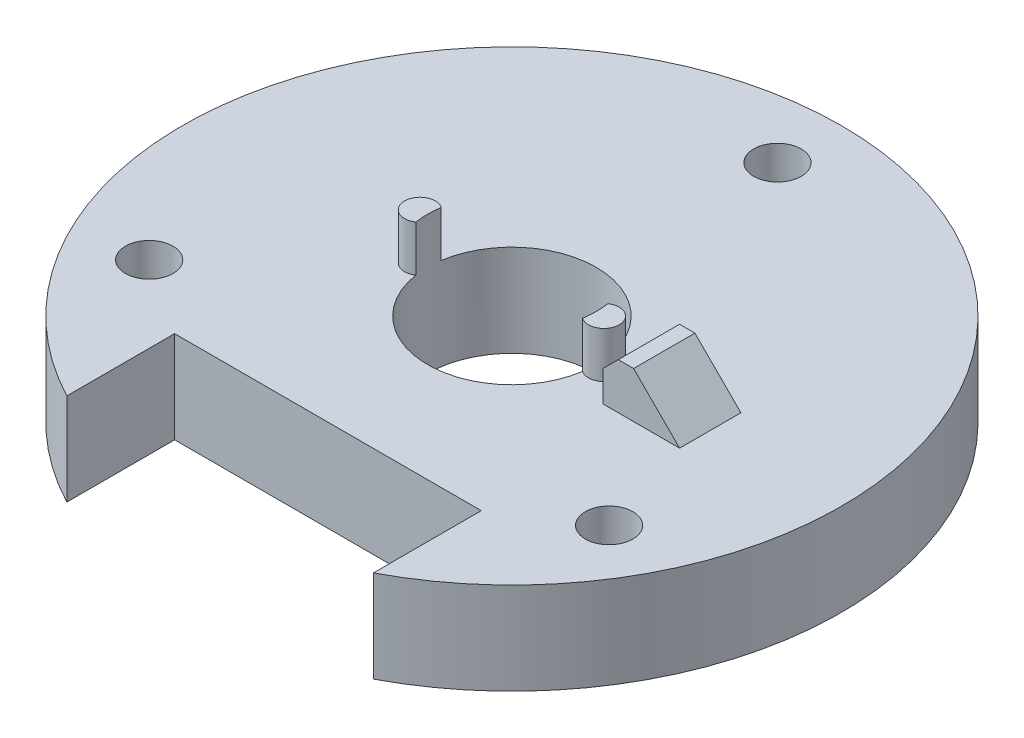
ISO-10303-21;
HEADER;
FILE_DESCRIPTION(('STEP AP214'),'2;1');
FILE_NAME('part.step','',(''),(''),'','','');
FILE_SCHEMA(('AUTOMOTIVE_DESIGN { 1 0 10303 214 1 1 1 1 }'));
ENDSEC;
DATA;
#1=APPLICATION_CONTEXT('core data for automotive mechanical design processes');
#2=APPLICATION_PROTOCOL_DEFINITION('international standard','automotive_design',2000,#1);
#3=PRODUCT_CONTEXT('',#1,'mechanical');
#4=PRODUCT('Part','Part','',(#3));
#5=PRODUCT_RELATED_PRODUCT_CATEGORY('part','',(#4));
#6=PRODUCT_DEFINITION_FORMATION('','',#4);
#7=PRODUCT_DEFINITION_CONTEXT('part definition',#1,'design');
#8=PRODUCT_DEFINITION('design','',#6,#7);
#9=PRODUCT_DEFINITION_SHAPE('','',#8);
#10=(LENGTH_UNIT() NAMED_UNIT(*) SI_UNIT(.MILLI.,.METRE.));
#11=(NAMED_UNIT(*) PLANE_ANGLE_UNIT() SI_UNIT($,.RADIAN.));
#12=(NAMED_UNIT(*) SI_UNIT($,.STERADIAN.) SOLID_ANGLE_UNIT());
#13=UNCERTAINTY_MEASURE_WITH_UNIT(LENGTH_MEASURE(1.E-05),#10,'distance_accuracy_value','');
#14=(GEOMETRIC_REPRESENTATION_CONTEXT(3) GLOBAL_UNCERTAINTY_ASSIGNED_CONTEXT((#13)) GLOBAL_UNIT_ASSIGNED_CONTEXT((#10,
#11,#12)) REPRESENTATION_CONTEXT('',''));
#15=CARTESIAN_POINT('',(0.,0.,0.));
#16=DIRECTION('',(0.,0.,1.));
#17=DIRECTION('',(1.,0.,0.));
#18=AXIS2_PLACEMENT_3D('',#15,#16,#17);
#19=CARTESIAN_POINT('',(0.,6.,0.));
#20=DIRECTION('',(0.,1.,0.));
#21=DIRECTION('',(0.,0.,1.));
#22=AXIS2_PLACEMENT_3D('',#19,#20,#21);
#23=PLANE('',#22);
#24=CARTESIAN_POINT('',(0.,6.,0.));
#25=DIRECTION('',(0.,1.,0.));
#26=DIRECTION('',(0.,0.,1.));
#27=AXIS2_PLACEMENT_3D('',#24,#25,#26);
#28=CIRCLE('',#27,5.5);
#29=CARTESIAN_POINT('',(-5.4375,6.,0.826797284707685));
#30=VERTEX_POINT('',#29);
#31=CARTESIAN_POINT('',(5.4375,6.,0.826797284707722));
#32=VERTEX_POINT('',#31);
#33=EDGE_CURVE('E210',#30,#32,#28,.T.);
#34=ORIENTED_EDGE('',*,*,#33,.F.);
#35=CARTESIAN_POINT('',(-6.,6.,0.));
#36=DIRECTION('',(0.,1.,0.));
#37=DIRECTION('',(0.,0.,1.));
#38=AXIS2_PLACEMENT_3D('',#35,#36,#37);
#39=CIRCLE('',#38,1.);
#40=CARTESIAN_POINT('',(-5.4375,6.,-0.826797284707684));
#41=VERTEX_POINT('',#40);
#42=EDGE_CURVE('E168',#41,#30,#39,.T.);
#43=ORIENTED_EDGE('',*,*,#42,.F.);
#44=CARTESIAN_POINT('',(5.43750000000001,6.,-0.826797284707646));
#45=VERTEX_POINT('',#44);
#46=EDGE_CURVE('E211',#45,#41,#28,.T.);
#47=ORIENTED_EDGE('',*,*,#46,.F.);
#48=CARTESIAN_POINT('',(6.,6.,0.));
#49=DIRECTION('',(0.,1.,0.));
#50=DIRECTION('',(0.,0.,1.));
#51=AXIS2_PLACEMENT_3D('',#48,#49,#50);
#52=CIRCLE('',#51,0.999999999999999);
#53=EDGE_CURVE('E171',#32,#45,#52,.T.);
#54=ORIENTED_EDGE('',*,*,#53,.F.);
#55=EDGE_LOOP('',(#34,#43,#47,#54));
#56=FACE_BOUND('',#55,.T.);
#57=DIRECTION('',(0.,0.,-1.));
#58=VECTOR('',#57,1.);
#59=CARTESIAN_POINT('',(10.,6.,0.));
#60=LINE('',#59,#58);
#61=CARTESIAN_POINT('',(10.,6.,19.0328663106743));
#62=VERTEX_POINT('',#61);
#63=CARTESIAN_POINT('',(10.,6.,12.));
#64=VERTEX_POINT('',#63);
#65=EDGE_CURVE('E206',#62,#64,#60,.T.);
#66=ORIENTED_EDGE('',*,*,#65,.F.);
#67=CARTESIAN_POINT('',(0.,6.,0.));
#68=DIRECTION('',(0.,1.,0.));
#69=DIRECTION('',(0.,0.,1.));
#70=AXIS2_PLACEMENT_3D('',#67,#68,#69);
#71=CIRCLE('',#70,21.5);
#72=CARTESIAN_POINT('',(-10.,6.,19.0328663106743));
#73=VERTEX_POINT('',#72);
#74=EDGE_CURVE('E233',#62,#73,#71,.T.);
#75=ORIENTED_EDGE('',*,*,#74,.T.);
#76=DIRECTION('',(0.,0.,1.));
#77=VECTOR('',#76,1.);
#78=CARTESIAN_POINT('',(-10.,6.,0.));
#79=LINE('',#78,#77);
#80=CARTESIAN_POINT('',(-10.,6.,12.));
#81=VERTEX_POINT('',#80);
#82=EDGE_CURVE('E193',#81,#73,#79,.T.);
#83=ORIENTED_EDGE('',*,*,#82,.F.);
#84=DIRECTION('',(-1.,0.,0.));
#85=VECTOR('',#84,1.);
#86=CARTESIAN_POINT('',(0.,6.,12.));
#87=LINE('',#86,#85);
#88=EDGE_CURVE('E208',#64,#81,#87,.T.);
#89=ORIENTED_EDGE('',*,*,#88,.F.);
#90=EDGE_LOOP('',(#66,#75,#83,#89));
#91=FACE_BOUND('',#90,.T.);
#92=CARTESIAN_POINT('',(15.,6.,8.66));
#93=DIRECTION('',(0.,1.,0.));
#94=DIRECTION('',(0.,0.,1.));
#95=AXIS2_PLACEMENT_3D('',#92,#93,#94);
#96=CIRCLE('',#95,1.55);
#97=CARTESIAN_POINT('',(15.,6.,10.21));
#98=VERTEX_POINT('',#97);
#99=EDGE_CURVE('E221',#98,#98,#96,.T.);
#100=ORIENTED_EDGE('',*,*,#99,.F.);
#101=EDGE_LOOP('',(#100));
#102=FACE_BOUND('',#101,.T.);
#103=CARTESIAN_POINT('',(0.,6.,-17.3207621135332));
#104=DIRECTION('',(0.,1.,0.));
#105=DIRECTION('',(0.,0.,1.));
#106=AXIS2_PLACEMENT_3D('',#103,#104,#105);
#107=CIRCLE('',#106,1.55);
#108=CARTESIAN_POINT('',(0.,6.,-15.7707621135332));
#109=VERTEX_POINT('',#108);
#110=EDGE_CURVE('E227',#109,#109,#107,.T.);
#111=ORIENTED_EDGE('',*,*,#110,.F.);
#112=EDGE_LOOP('',(#111));
#113=FACE_BOUND('',#112,.T.);
#114=CARTESIAN_POINT('',(-15.,6.,8.66));
#115=DIRECTION('',(0.,1.,0.));
#116=DIRECTION('',(0.,0.,1.));
#117=AXIS2_PLACEMENT_3D('',#114,#115,#116);
#118=CIRCLE('',#117,1.55);
#119=CARTESIAN_POINT('',(-15.,6.,10.21));
#120=VERTEX_POINT('',#119);
#121=EDGE_CURVE('E215',#120,#120,#118,.T.);
#122=ORIENTED_EDGE('',*,*,#121,.F.);
#123=EDGE_LOOP('',(#122));
#124=FACE_BOUND('',#123,.T.);
#125=DIRECTION('',(-1.,0.,0.));
#126=VECTOR('',#125,1.);
#127=CARTESIAN_POINT('',(7.93750000000001,6.,-2.));
#128=LINE('',#127,#126);
#129=CARTESIAN_POINT('',(12.9375,6.,-2.));
#130=VERTEX_POINT('',#129);
#131=CARTESIAN_POINT('',(7.93750000000001,6.,-2.));
#132=VERTEX_POINT('',#131);
#133=EDGE_CURVE('E55',#130,#132,#128,.T.);
#134=ORIENTED_EDGE('',*,*,#133,.F.);
#135=DIRECTION('',(0.,0.,1.));
#136=VECTOR('',#135,1.);
#137=CARTESIAN_POINT('',(12.9375,6.,0.));
#138=LINE('',#137,#136);
#139=CARTESIAN_POINT('',(12.9375,6.,2.));
#140=VERTEX_POINT('',#139);
#141=EDGE_CURVE('E251',#130,#140,#138,.T.);
#142=ORIENTED_EDGE('',*,*,#141,.T.);
#143=DIRECTION('',(1.,0.,0.));
#144=VECTOR('',#143,1.);
#145=CARTESIAN_POINT('',(7.93750000000001,6.,2.));
#146=LINE('',#145,#144);
#147=CARTESIAN_POINT('',(7.93750000000001,6.,2.));
#148=VERTEX_POINT('',#147);
#149=EDGE_CURVE('E62',#148,#140,#146,.T.);
#150=ORIENTED_EDGE('',*,*,#149,.F.);
#151=DIRECTION('',(0.,0.,1.));
#152=VECTOR('',#151,1.);
#153=CARTESIAN_POINT('',(7.93750000000001,6.,-2.));
#154=LINE('',#153,#152);
#155=EDGE_CURVE('E155',#132,#148,#154,.T.);
#156=ORIENTED_EDGE('',*,*,#155,.F.);
#157=EDGE_LOOP('',(#134,#142,#150,#156));
#158=FACE_BOUND('',#157,.T.);
#159=ADVANCED_FACE('F39',(#56,#91,#102,#113,#124,#158),#23,.T.);
#160=CARTESIAN_POINT('',(0.,0.,0.));
#161=DIRECTION('',(0.,1.,0.));
#162=DIRECTION('',(0.,0.,1.));
#163=AXIS2_PLACEMENT_3D('',#160,#161,#162);
#164=PLANE('',#163);
#165=CARTESIAN_POINT('',(0.,0.,0.));
#166=DIRECTION('',(0.,-1.,0.));
#167=DIRECTION('',(0.,0.,-1.));
#168=AXIS2_PLACEMENT_3D('',#165,#166,#167);
#169=CIRCLE('',#168,5.5);
#170=CARTESIAN_POINT('',(0.,0.,-5.5));
#171=VERTEX_POINT('',#170);
#172=EDGE_CURVE('E190',#171,#171,#169,.T.);
#173=ORIENTED_EDGE('',*,*,#172,.F.);
#174=EDGE_LOOP('',(#173));
#175=FACE_BOUND('',#174,.T.);
#176=CARTESIAN_POINT('',(0.,0.,0.));
#177=DIRECTION('',(0.,1.,0.));
#178=DIRECTION('',(0.,0.,1.));
#179=AXIS2_PLACEMENT_3D('',#176,#177,#178);
#180=CIRCLE('',#179,21.5);
#181=CARTESIAN_POINT('',(10.,0.,19.0328663106743));
#182=VERTEX_POINT('',#181);
#183=CARTESIAN_POINT('',(-10.,0.,19.0328663106743));
#184=VERTEX_POINT('',#183);
#185=EDGE_CURVE('E230',#182,#184,#180,.T.);
#186=ORIENTED_EDGE('',*,*,#185,.F.);
#187=DIRECTION('',(0.,0.,1.));
#188=VECTOR('',#187,1.);
#189=CARTESIAN_POINT('',(10.,0.,12.));
#190=LINE('',#189,#188);
#191=CARTESIAN_POINT('',(10.,0.,12.));
#192=VERTEX_POINT('',#191);
#193=EDGE_CURVE('E194',#192,#182,#190,.T.);
#194=ORIENTED_EDGE('',*,*,#193,.F.);
#195=DIRECTION('',(1.,0.,0.));
#196=VECTOR('',#195,1.);
#197=CARTESIAN_POINT('',(10.,0.,12.));
#198=LINE('',#197,#196);
#199=CARTESIAN_POINT('',(-10.,0.,12.));
#200=VERTEX_POINT('',#199);
#201=EDGE_CURVE('E197',#200,#192,#198,.T.);
#202=ORIENTED_EDGE('',*,*,#201,.F.);
#203=DIRECTION('',(0.,0.,-1.));
#204=VECTOR('',#203,1.);
#205=CARTESIAN_POINT('',(-10.,0.,12.));
#206=LINE('',#205,#204);
#207=EDGE_CURVE('E201',#184,#200,#206,.T.);
#208=ORIENTED_EDGE('',*,*,#207,.F.);
#209=EDGE_LOOP('',(#186,#194,#202,#208));
#210=FACE_BOUND('',#209,.T.);
#211=CARTESIAN_POINT('',(0.,0.,-17.3207621135332));
#212=DIRECTION('',(0.,1.,0.));
#213=DIRECTION('',(0.,0.,1.));
#214=AXIS2_PLACEMENT_3D('',#211,#212,#213);
#215=CIRCLE('',#214,1.55);
#216=CARTESIAN_POINT('',(0.,0.,-15.7707621135332));
#217=VERTEX_POINT('',#216);
#218=EDGE_CURVE('E224',#217,#217,#215,.T.);
#219=ORIENTED_EDGE('',*,*,#218,.T.);
#220=EDGE_LOOP('',(#219));
#221=FACE_BOUND('',#220,.T.);
#222=CARTESIAN_POINT('',(15.,0.,8.66));
#223=DIRECTION('',(0.,1.,0.));
#224=DIRECTION('',(0.,0.,1.));
#225=AXIS2_PLACEMENT_3D('',#222,#223,#224);
#226=CIRCLE('',#225,1.55);
#227=CARTESIAN_POINT('',(15.,0.,10.21));
#228=VERTEX_POINT('',#227);
#229=EDGE_CURVE('E218',#228,#228,#226,.T.);
#230=ORIENTED_EDGE('',*,*,#229,.T.);
#231=EDGE_LOOP('',(#230));
#232=FACE_BOUND('',#231,.T.);
#233=CARTESIAN_POINT('',(-15.,0.,8.66));
#234=DIRECTION('',(0.,1.,0.));
#235=DIRECTION('',(0.,0.,1.));
#236=AXIS2_PLACEMENT_3D('',#233,#234,#235);
#237=CIRCLE('',#236,1.55);
#238=CARTESIAN_POINT('',(-15.,0.,10.21));
#239=VERTEX_POINT('',#238);
#240=EDGE_CURVE('E214',#239,#239,#237,.T.);
#241=ORIENTED_EDGE('',*,*,#240,.T.);
#242=EDGE_LOOP('',(#241));
#243=FACE_BOUND('',#242,.T.);
#244=ADVANCED_FACE('F271',(#175,#210,#221,#232,#243),#164,.F.);
#245=CARTESIAN_POINT('',(0.,6.,0.));
#246=DIRECTION('',(0.,-1.,0.));
#247=DIRECTION('',(0.,0.,-1.));
#248=AXIS2_PLACEMENT_3D('',#245,#246,#247);
#249=CYLINDRICAL_SURFACE('',#248,21.5);
#250=ORIENTED_EDGE('',*,*,#74,.F.);
#251=DIRECTION('',(0.,-1.,0.));
#252=VECTOR('',#251,1.);
#253=CARTESIAN_POINT('',(10.,6.,19.0328663106743));
#254=LINE('',#253,#252);
#255=EDGE_CURVE('E241',#62,#182,#254,.T.);
#256=ORIENTED_EDGE('',*,*,#255,.T.);
#257=ORIENTED_EDGE('',*,*,#185,.T.);
#258=DIRECTION('',(0.,-1.,0.));
#259=VECTOR('',#258,1.);
#260=CARTESIAN_POINT('',(-10.,6.,19.0328663106743));
#261=LINE('',#260,#259);
#262=EDGE_CURVE('E236',#184,#73,#261,.F.);
#263=ORIENTED_EDGE('',*,*,#262,.T.);
#264=EDGE_LOOP('',(#250,#256,#257,#263));
#265=FACE_BOUND('',#264,.T.);
#266=ADVANCED_FACE('F278',(#265),#249,.T.);
#267=CARTESIAN_POINT('',(0.,6.,-17.3207621135332));
#268=DIRECTION('',(0.,-1.,0.));
#269=DIRECTION('',(0.,0.,-1.));
#270=AXIS2_PLACEMENT_3D('',#267,#268,#269);
#271=CYLINDRICAL_SURFACE('',#270,1.55);
#272=ORIENTED_EDGE('',*,*,#110,.T.);
#273=EDGE_LOOP('',(#272));
#274=FACE_BOUND('',#273,.T.);
#275=ORIENTED_EDGE('',*,*,#218,.F.);
#276=EDGE_LOOP('',(#275));
#277=FACE_BOUND('',#276,.T.);
#278=ADVANCED_FACE('F284',(#274,#277),#271,.F.);
#279=CARTESIAN_POINT('',(15.,6.,8.66));
#280=DIRECTION('',(0.,-1.,0.));
#281=DIRECTION('',(0.,0.,-1.));
#282=AXIS2_PLACEMENT_3D('',#279,#280,#281);
#283=CYLINDRICAL_SURFACE('',#282,1.55);
#284=ORIENTED_EDGE('',*,*,#99,.T.);
#285=EDGE_LOOP('',(#284));
#286=FACE_BOUND('',#285,.T.);
#287=ORIENTED_EDGE('',*,*,#229,.F.);
#288=EDGE_LOOP('',(#287));
#289=FACE_BOUND('',#288,.T.);
#290=ADVANCED_FACE('F291',(#286,#289),#283,.F.);
#291=CARTESIAN_POINT('',(-15.,6.,8.66));
#292=DIRECTION('',(0.,-1.,0.));
#293=DIRECTION('',(0.,0.,-1.));
#294=AXIS2_PLACEMENT_3D('',#291,#292,#293);
#295=CYLINDRICAL_SURFACE('',#294,1.55);
#296=ORIENTED_EDGE('',*,*,#121,.T.);
#297=EDGE_LOOP('',(#296));
#298=FACE_BOUND('',#297,.T.);
#299=ORIENTED_EDGE('',*,*,#240,.F.);
#300=EDGE_LOOP('',(#299));
#301=FACE_BOUND('',#300,.T.);
#302=ADVANCED_FACE('F325',(#298,#301),#295,.F.);
#303=CARTESIAN_POINT('',(10.,12.,12.));
#304=DIRECTION('',(1.,0.,0.));
#305=DIRECTION('',(0.,0.,-1.));
#306=AXIS2_PLACEMENT_3D('',#303,#304,#305);
#307=PLANE('',#306);
#308=ORIENTED_EDGE('',*,*,#65,.T.);
#309=DIRECTION('',(0.,-1.,0.));
#310=VECTOR('',#309,1.);
#311=CARTESIAN_POINT('',(10.,12.,12.));
#312=LINE('',#311,#310);
#313=EDGE_CURVE('E189',#64,#192,#312,.T.);
#314=ORIENTED_EDGE('',*,*,#313,.T.);
#315=ORIENTED_EDGE('',*,*,#193,.T.);
#316=ORIENTED_EDGE('',*,*,#255,.F.);
#317=EDGE_LOOP('',(#308,#314,#315,#316));
#318=FACE_BOUND('',#317,.T.);
#319=ADVANCED_FACE('F301',(#318),#307,.F.);
#320=CARTESIAN_POINT('',(10.,12.,12.));
#321=DIRECTION('',(0.,0.,-1.));
#322=DIRECTION('',(-1.,0.,0.));
#323=AXIS2_PLACEMENT_3D('',#320,#321,#322);
#324=PLANE('',#323);
#325=ORIENTED_EDGE('',*,*,#88,.T.);
#326=DIRECTION('',(0.,-1.,0.));
#327=VECTOR('',#326,1.);
#328=CARTESIAN_POINT('',(-10.,12.,12.));
#329=LINE('',#328,#327);
#330=EDGE_CURVE('E195',#81,#200,#329,.T.);
#331=ORIENTED_EDGE('',*,*,#330,.T.);
#332=ORIENTED_EDGE('',*,*,#201,.T.);
#333=ORIENTED_EDGE('',*,*,#313,.F.);
#334=EDGE_LOOP('',(#325,#331,#332,#333));
#335=FACE_BOUND('',#334,.T.);
#336=ADVANCED_FACE('F303',(#335),#324,.F.);
#337=CARTESIAN_POINT('',(-10.,12.,12.));
#338=DIRECTION('',(-1.,0.,0.));
#339=DIRECTION('',(0.,0.,1.));
#340=AXIS2_PLACEMENT_3D('',#337,#338,#339);
#341=PLANE('',#340);
#342=ORIENTED_EDGE('',*,*,#82,.T.);
#343=ORIENTED_EDGE('',*,*,#262,.F.);
#344=ORIENTED_EDGE('',*,*,#207,.T.);
#345=ORIENTED_EDGE('',*,*,#330,.F.);
#346=EDGE_LOOP('',(#342,#343,#344,#345));
#347=FACE_BOUND('',#346,.T.);
#348=ADVANCED_FACE('F311',(#347),#341,.F.);
#349=CARTESIAN_POINT('',(0.,12.,0.));
#350=DIRECTION('',(0.,-1.,0.));
#351=DIRECTION('',(0.,0.,-1.));
#352=AXIS2_PLACEMENT_3D('',#349,#350,#351);
#353=CYLINDRICAL_SURFACE('',#352,5.5);
#354=ORIENTED_EDGE('',*,*,#46,.T.);
#355=DIRECTION('',(0.,-1.,0.));
#356=VECTOR('',#355,1.);
#357=CARTESIAN_POINT('',(-5.4375,9.,-0.826797284707684));
#358=LINE('',#357,#356);
#359=CARTESIAN_POINT('',(-5.4375,9.,-0.826797284707684));
#360=VERTEX_POINT('',#359);
#361=EDGE_CURVE('E163',#360,#41,#358,.T.);
#362=ORIENTED_EDGE('',*,*,#361,.F.);
#363=CARTESIAN_POINT('',(0.,9.,0.));
#364=DIRECTION('',(0.,-1.,0.));
#365=DIRECTION('',(0.,0.,1.));
#366=AXIS2_PLACEMENT_3D('',#363,#364,#365);
#367=CIRCLE('',#366,5.5);
#368=CARTESIAN_POINT('',(-5.4375,9.,0.826797284707685));
#369=VERTEX_POINT('',#368);
#370=EDGE_CURVE('E172',#369,#360,#367,.T.);
#371=ORIENTED_EDGE('',*,*,#370,.F.);
#372=DIRECTION('',(0.,-1.,0.));
#373=VECTOR('',#372,1.);
#374=CARTESIAN_POINT('',(-5.4375,9.,0.826797284707685));
#375=LINE('',#374,#373);
#376=EDGE_CURVE('E165',#369,#30,#375,.T.);
#377=ORIENTED_EDGE('',*,*,#376,.T.);
#378=ORIENTED_EDGE('',*,*,#33,.T.);
#379=DIRECTION('',(0.,-1.,0.));
#380=VECTOR('',#379,1.);
#381=CARTESIAN_POINT('',(5.4375,9.,0.826797284707722));
#382=LINE('',#381,#380);
#383=CARTESIAN_POINT('',(5.4375,9.,0.826797284707722));
#384=VERTEX_POINT('',#383);
#385=EDGE_CURVE('E186',#384,#32,#382,.T.);
#386=ORIENTED_EDGE('',*,*,#385,.F.);
#387=CARTESIAN_POINT('',(0.,9.,0.));
#388=DIRECTION('',(0.,-1.,0.));
#389=DIRECTION('',(0.,0.,1.));
#390=AXIS2_PLACEMENT_3D('',#387,#388,#389);
#391=CIRCLE('',#390,5.5);
#392=CARTESIAN_POINT('',(5.43750000000001,9.,-0.826797284707646));
#393=VERTEX_POINT('',#392);
#394=EDGE_CURVE('E176',#393,#384,#391,.T.);
#395=ORIENTED_EDGE('',*,*,#394,.F.);
#396=DIRECTION('',(0.,-1.,0.));
#397=VECTOR('',#396,1.);
#398=CARTESIAN_POINT('',(5.43750000000001,9.,-0.826797284707646));
#399=LINE('',#398,#397);
#400=EDGE_CURVE('E181',#393,#45,#399,.T.);
#401=ORIENTED_EDGE('',*,*,#400,.T.);
#402=EDGE_LOOP('',(#354,#362,#371,#377,#378,#386,#395,#401));
#403=FACE_BOUND('',#402,.T.);
#404=ORIENTED_EDGE('',*,*,#172,.T.);
#405=EDGE_LOOP('',(#404));
#406=FACE_BOUND('',#405,.T.);
#407=ADVANCED_FACE('F313',(#403,#406),#353,.F.);
#408=CARTESIAN_POINT('',(6.,9.,0.));
#409=DIRECTION('',(0.,-1.,0.));
#410=DIRECTION('',(0.,0.,-1.));
#411=AXIS2_PLACEMENT_3D('',#408,#409,#410);
#412=CYLINDRICAL_SURFACE('',#411,0.999999999999999);
#413=ORIENTED_EDGE('',*,*,#53,.T.);
#414=ORIENTED_EDGE('',*,*,#400,.F.);
#415=CARTESIAN_POINT('',(6.,9.,0.));
#416=DIRECTION('',(0.,1.,0.));
#417=DIRECTION('',(0.,0.,1.));
#418=AXIS2_PLACEMENT_3D('',#415,#416,#417);
#419=CIRCLE('',#418,0.999999999999999);
#420=EDGE_CURVE('E179',#384,#393,#419,.T.);
#421=ORIENTED_EDGE('',*,*,#420,.F.);
#422=ORIENTED_EDGE('',*,*,#385,.T.);
#423=EDGE_LOOP('',(#413,#414,#421,#422));
#424=FACE_BOUND('',#423,.T.);
#425=ADVANCED_FACE('F319',(#424),#412,.T.);
#426=CARTESIAN_POINT('',(3.,9.,0.));
#427=DIRECTION('',(0.,1.,0.));
#428=DIRECTION('',(0.,0.,1.));
#429=AXIS2_PLACEMENT_3D('',#426,#427,#428);
#430=PLANE('',#429);
#431=ORIENTED_EDGE('',*,*,#394,.T.);
#432=ORIENTED_EDGE('',*,*,#420,.T.);
#433=EDGE_LOOP('',(#431,#432));
#434=FACE_BOUND('',#433,.T.);
#435=ADVANCED_FACE('F384',(#434),#430,.T.);
#436=CARTESIAN_POINT('',(-6.,9.,0.));
#437=DIRECTION('',(0.,-1.,0.));
#438=DIRECTION('',(0.,0.,-1.));
#439=AXIS2_PLACEMENT_3D('',#436,#437,#438);
#440=CYLINDRICAL_SURFACE('',#439,1.);
#441=ORIENTED_EDGE('',*,*,#42,.T.);
#442=ORIENTED_EDGE('',*,*,#376,.F.);
#443=CARTESIAN_POINT('',(-6.,9.,0.));
#444=DIRECTION('',(0.,1.,0.));
#445=DIRECTION('',(0.,0.,1.));
#446=AXIS2_PLACEMENT_3D('',#443,#444,#445);
#447=CIRCLE('',#446,1.);
#448=EDGE_CURVE('E167',#360,#369,#447,.T.);
#449=ORIENTED_EDGE('',*,*,#448,.F.);
#450=ORIENTED_EDGE('',*,*,#361,.T.);
#451=EDGE_LOOP('',(#441,#442,#449,#450));
#452=FACE_BOUND('',#451,.T.);
#453=ADVANCED_FACE('F395',(#452),#440,.T.);
#454=CARTESIAN_POINT('',(-3.,9.,0.));
#455=DIRECTION('',(0.,1.,0.));
#456=DIRECTION('',(0.,0.,1.));
#457=AXIS2_PLACEMENT_3D('',#454,#455,#456);
#458=PLANE('',#457);
#459=ORIENTED_EDGE('',*,*,#370,.T.);
#460=ORIENTED_EDGE('',*,*,#448,.T.);
#461=EDGE_LOOP('',(#459,#460));
#462=FACE_BOUND('',#461,.T.);
#463=ADVANCED_FACE('F406',(#462),#458,.T.);
#464=CARTESIAN_POINT('',(7.93750000000001,9.,-2.));
#465=DIRECTION('',(1.,0.,0.));
#466=DIRECTION('',(0.,0.,-1.));
#467=AXIS2_PLACEMENT_3D('',#464,#465,#466);
#468=PLANE('',#467);
#469=DIRECTION('',(0.,-1.,0.));
#470=VECTOR('',#469,1.);
#471=CARTESIAN_POINT('',(7.93750000000001,9.,2.));
#472=LINE('',#471,#470);
#473=CARTESIAN_POINT('',(7.93750000000001,8.,2.));
#474=VERTEX_POINT('',#473);
#475=EDGE_CURVE('E161',#474,#148,#472,.T.);
#476=ORIENTED_EDGE('',*,*,#475,.F.);
#477=DIRECTION('',(0.,0.,-1.));
#478=VECTOR('',#477,1.);
#479=CARTESIAN_POINT('',(7.93750000000001,8.,-2.));
#480=LINE('',#479,#478);
#481=CARTESIAN_POINT('',(7.93750000000001,8.,-2.));
#482=VERTEX_POINT('',#481);
#483=EDGE_CURVE('E247',#474,#482,#480,.T.);
#484=ORIENTED_EDGE('',*,*,#483,.T.);
#485=DIRECTION('',(0.,-1.,0.));
#486=VECTOR('',#485,1.);
#487=CARTESIAN_POINT('',(7.93750000000001,9.,-2.));
#488=LINE('',#487,#486);
#489=EDGE_CURVE('E152',#482,#132,#488,.T.);
#490=ORIENTED_EDGE('',*,*,#489,.T.);
#491=ORIENTED_EDGE('',*,*,#155,.T.);
#492=EDGE_LOOP('',(#476,#484,#490,#491));
#493=FACE_BOUND('',#492,.T.);
#494=ADVANCED_FACE('F257',(#493),#468,.F.);
#495=CARTESIAN_POINT('',(7.93750000000001,9.,2.));
#496=DIRECTION('',(0.,0.,-1.));
#497=DIRECTION('',(-1.,0.,0.));
#498=AXIS2_PLACEMENT_3D('',#495,#496,#497);
#499=PLANE('',#498);
#500=DIRECTION('',(1.,0.,0.));
#501=VECTOR('',#500,1.);
#502=CARTESIAN_POINT('',(7.93750000000001,9.,2.));
#503=LINE('',#502,#501);
#504=CARTESIAN_POINT('',(8.9375,9.,2.));
#505=VERTEX_POINT('',#504);
#506=CARTESIAN_POINT('',(9.93750000000001,9.,2.));
#507=VERTEX_POINT('',#506);
#508=EDGE_CURVE('E136',#505,#507,#503,.T.);
#509=ORIENTED_EDGE('',*,*,#508,.F.);
#510=DIRECTION('',(-0.707106781186545,-0.70710678118655,0.));
#511=VECTOR('',#510,1.);
#512=CARTESIAN_POINT('',(8.9375,9.,2.));
#513=LINE('',#512,#511);
#514=EDGE_CURVE('E245',#505,#474,#513,.T.);
#515=ORIENTED_EDGE('',*,*,#514,.T.);
#516=ORIENTED_EDGE('',*,*,#475,.T.);
#517=ORIENTED_EDGE('',*,*,#149,.T.);
#518=DIRECTION('',(-0.707106781186544,0.707106781186551,0.));
#519=VECTOR('',#518,1.);
#520=CARTESIAN_POINT('',(8.93750000000003,10.,2.));
#521=LINE('',#520,#519);
#522=EDGE_CURVE('E11',#140,#507,#521,.T.);
#523=ORIENTED_EDGE('',*,*,#522,.T.);
#524=EDGE_LOOP('',(#509,#515,#516,#517,#523));
#525=FACE_BOUND('',#524,.T.);
#526=ADVANCED_FACE('F135',(#525),#499,.F.);
#527=CARTESIAN_POINT('',(7.93750000000001,9.,-2.));
#528=DIRECTION('',(0.,0.,1.));
#529=DIRECTION('',(1.,0.,0.));
#530=AXIS2_PLACEMENT_3D('',#527,#528,#529);
#531=PLANE('',#530);
#532=ORIENTED_EDGE('',*,*,#489,.F.);
#533=DIRECTION('',(0.707106781186545,0.70710678118655,0.));
#534=VECTOR('',#533,1.);
#535=CARTESIAN_POINT('',(8.9375,9.,-2.));
#536=LINE('',#535,#534);
#537=CARTESIAN_POINT('',(8.9375,9.,-2.));
#538=VERTEX_POINT('',#537);
#539=EDGE_CURVE('E249',#482,#538,#536,.T.);
#540=ORIENTED_EDGE('',*,*,#539,.T.);
#541=DIRECTION('',(-1.,0.,0.));
#542=VECTOR('',#541,1.);
#543=CARTESIAN_POINT('',(7.93750000000001,9.,-2.));
#544=LINE('',#543,#542);
#545=CARTESIAN_POINT('',(9.93750000000001,9.,-2.));
#546=VERTEX_POINT('',#545);
#547=EDGE_CURVE('E150',#546,#538,#544,.T.);
#548=ORIENTED_EDGE('',*,*,#547,.F.);
#549=DIRECTION('',(0.707106781186544,-0.707106781186551,0.));
#550=VECTOR('',#549,1.);
#551=CARTESIAN_POINT('',(8.93750000000003,10.,-2.));
#552=LINE('',#551,#550);
#553=EDGE_CURVE('E48',#546,#130,#552,.T.);
#554=ORIENTED_EDGE('',*,*,#553,.T.);
#555=ORIENTED_EDGE('',*,*,#133,.T.);
#556=EDGE_LOOP('',(#532,#540,#548,#554,#555));
#557=FACE_BOUND('',#556,.T.);
#558=ADVANCED_FACE('F254',(#557),#531,.F.);
#559=CARTESIAN_POINT('',(0.,9.,0.));
#560=DIRECTION('',(0.,1.,0.));
#561=DIRECTION('',(0.,0.,1.));
#562=AXIS2_PLACEMENT_3D('',#559,#560,#561);
#563=PLANE('',#562);
#564=ORIENTED_EDGE('',*,*,#547,.T.);
#565=DIRECTION('',(0.,0.,1.));
#566=VECTOR('',#565,1.);
#567=CARTESIAN_POINT('',(8.9375,9.,2.));
#568=LINE('',#567,#566);
#569=EDGE_CURVE('E148',#538,#505,#568,.T.);
#570=ORIENTED_EDGE('',*,*,#569,.T.);
#571=ORIENTED_EDGE('',*,*,#508,.T.);
#572=DIRECTION('',(0.,0.,-1.));
#573=VECTOR('',#572,1.);
#574=CARTESIAN_POINT('',(9.93750000000001,9.,-2.));
#575=LINE('',#574,#573);
#576=EDGE_CURVE('E145',#507,#546,#575,.T.);
#577=ORIENTED_EDGE('',*,*,#576,.T.);
#578=EDGE_LOOP('',(#564,#570,#571,#577));
#579=FACE_BOUND('',#578,.T.);
#580=ADVANCED_FACE('F144',(#579),#563,.T.);
#581=CARTESIAN_POINT('',(8.9375,9.,0.));
#582=DIRECTION('',(-0.70710678118655,0.707106781186545,0.));
#583=DIRECTION('',(0.,0.,-1.));
#584=AXIS2_PLACEMENT_3D('',#581,#582,#583);
#585=PLANE('',#584);
#586=ORIENTED_EDGE('',*,*,#539,.F.);
#587=ORIENTED_EDGE('',*,*,#483,.F.);
#588=ORIENTED_EDGE('',*,*,#514,.F.);
#589=ORIENTED_EDGE('',*,*,#569,.F.);
#590=EDGE_LOOP('',(#586,#587,#588,#589));
#591=FACE_BOUND('',#590,.T.);
#592=ADVANCED_FACE('F261',(#591),#585,.T.);
#593=CARTESIAN_POINT('',(9.93750000000001,9.00000000000002,-2.));
#594=DIRECTION('',(-0.707106781186551,-0.707106781186544,0.));
#595=DIRECTION('',(0.,0.,-1.));
#596=AXIS2_PLACEMENT_3D('',#593,#594,#595);
#597=PLANE('',#596);
#598=ORIENTED_EDGE('',*,*,#522,.F.);
#599=ORIENTED_EDGE('',*,*,#141,.F.);
#600=ORIENTED_EDGE('',*,*,#553,.F.);
#601=ORIENTED_EDGE('',*,*,#576,.F.);
#602=EDGE_LOOP('',(#598,#599,#600,#601));
#603=FACE_BOUND('',#602,.T.);
#604=ADVANCED_FACE('F42',(#603),#597,.F.);
#605=CLOSED_SHELL('',(#159,#244,#266,#278,#290,#302,#319,#336,#348,#407,#425,#435,#453,#463,
#494,#526,#558,#580,#592,#604));
#606=MANIFOLD_SOLID_BREP('B2',#605);
#607=ADVANCED_BREP_SHAPE_REPRESENTATION('',(#18,#606),#14);
#608=SHAPE_DEFINITION_REPRESENTATION(#9,#607);
ENDSEC;
END-ISO-10303-21;
